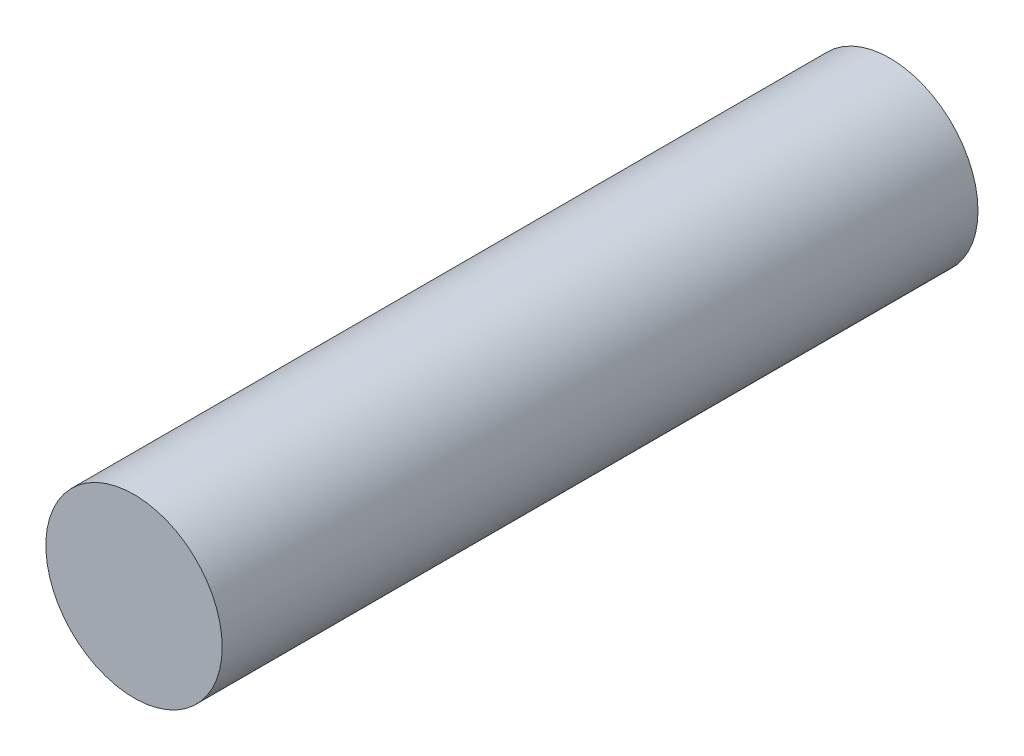
ISO-10303-21;
HEADER;
FILE_DESCRIPTION(('STEP AP214'),'2;1');
FILE_NAME('part.step','',(''),(''),'','','');
FILE_SCHEMA(('AUTOMOTIVE_DESIGN { 1 0 10303 214 1 1 1 1 }'));
ENDSEC;
DATA;
#1=APPLICATION_CONTEXT('core data for automotive mechanical design processes');
#2=APPLICATION_PROTOCOL_DEFINITION('international standard','automotive_design',2000,#1);
#3=PRODUCT_CONTEXT('',#1,'mechanical');
#4=PRODUCT('Part','Part','',(#3));
#5=PRODUCT_RELATED_PRODUCT_CATEGORY('part','',(#4));
#6=PRODUCT_DEFINITION_FORMATION('','',#4);
#7=PRODUCT_DEFINITION_CONTEXT('part definition',#1,'design');
#8=PRODUCT_DEFINITION('design','',#6,#7);
#9=PRODUCT_DEFINITION_SHAPE('','',#8);
#10=(LENGTH_UNIT() NAMED_UNIT(*) SI_UNIT(.MILLI.,.METRE.));
#11=(NAMED_UNIT(*) PLANE_ANGLE_UNIT() SI_UNIT($,.RADIAN.));
#12=(NAMED_UNIT(*) SI_UNIT($,.STERADIAN.) SOLID_ANGLE_UNIT());
#13=UNCERTAINTY_MEASURE_WITH_UNIT(LENGTH_MEASURE(1.E-05),#10,'distance_accuracy_value','');
#14=(GEOMETRIC_REPRESENTATION_CONTEXT(3) GLOBAL_UNCERTAINTY_ASSIGNED_CONTEXT((#13)) GLOBAL_UNIT_ASSIGNED_CONTEXT((#10,
#11,#12)) REPRESENTATION_CONTEXT('',''));
#15=CARTESIAN_POINT('',(0.,0.,0.));
#16=DIRECTION('',(0.,0.,1.));
#17=DIRECTION('',(1.,0.,0.));
#18=AXIS2_PLACEMENT_3D('',#15,#16,#17);
#19=CARTESIAN_POINT('',(0.,0.,30.));
#20=DIRECTION('',(0.,0.,-1.));
#21=DIRECTION('',(-1.,0.,0.));
#22=AXIS2_PLACEMENT_3D('',#19,#20,#21);
#23=CYLINDRICAL_SURFACE('',#22,3.5);
#24=CARTESIAN_POINT('',(0.,0.,30.));
#25=DIRECTION('',(0.,0.,1.));
#26=DIRECTION('',(1.,0.,0.));
#27=AXIS2_PLACEMENT_3D('',#24,#25,#26);
#28=CIRCLE('',#27,3.5);
#29=CARTESIAN_POINT('',(3.5,0.,30.));
#30=VERTEX_POINT('',#29);
#31=EDGE_CURVE('E10',#30,#30,#28,.T.);
#32=ORIENTED_EDGE('',*,*,#31,.F.);
#33=EDGE_LOOP('',(#32));
#34=FACE_BOUND('',#33,.T.);
#35=CARTESIAN_POINT('',(0.,0.,0.));
#36=DIRECTION('',(0.,0.,1.));
#37=DIRECTION('',(1.,0.,0.));
#38=AXIS2_PLACEMENT_3D('',#35,#36,#37);
#39=CIRCLE('',#38,3.5);
#40=CARTESIAN_POINT('',(3.5,0.,0.));
#41=VERTEX_POINT('',#40);
#42=EDGE_CURVE('E44',#41,#41,#39,.T.);
#43=ORIENTED_EDGE('',*,*,#42,.T.);
#44=EDGE_LOOP('',(#43));
#45=FACE_BOUND('',#44,.T.);
#46=ADVANCED_FACE('F41',(#34,#45),#23,.T.);
#47=CARTESIAN_POINT('',(0.,0.,30.));
#48=DIRECTION('',(0.,0.,1.));
#49=DIRECTION('',(1.,0.,0.));
#50=AXIS2_PLACEMENT_3D('',#47,#48,#49);
#51=PLANE('',#50);
#52=ORIENTED_EDGE('',*,*,#31,.T.);
#53=EDGE_LOOP('',(#52));
#54=FACE_BOUND('',#53,.T.);
#55=ADVANCED_FACE('F58',(#54),#51,.T.);
#56=CARTESIAN_POINT('',(0.,0.,0.));
#57=DIRECTION('',(0.,0.,1.));
#58=DIRECTION('',(1.,0.,0.));
#59=AXIS2_PLACEMENT_3D('',#56,#57,#58);
#60=PLANE('',#59);
#61=ORIENTED_EDGE('',*,*,#42,.F.);
#62=EDGE_LOOP('',(#61));
#63=FACE_BOUND('',#62,.T.);
#64=ADVANCED_FACE('F56',(#63),#60,.F.);
#65=CLOSED_SHELL('',(#46,#55,#64));
#66=MANIFOLD_SOLID_BREP('B2',#65);
#67=ADVANCED_BREP_SHAPE_REPRESENTATION('',(#18,#66),#14);
#68=SHAPE_DEFINITION_REPRESENTATION(#9,#67);
ENDSEC;
END-ISO-10303-21;
